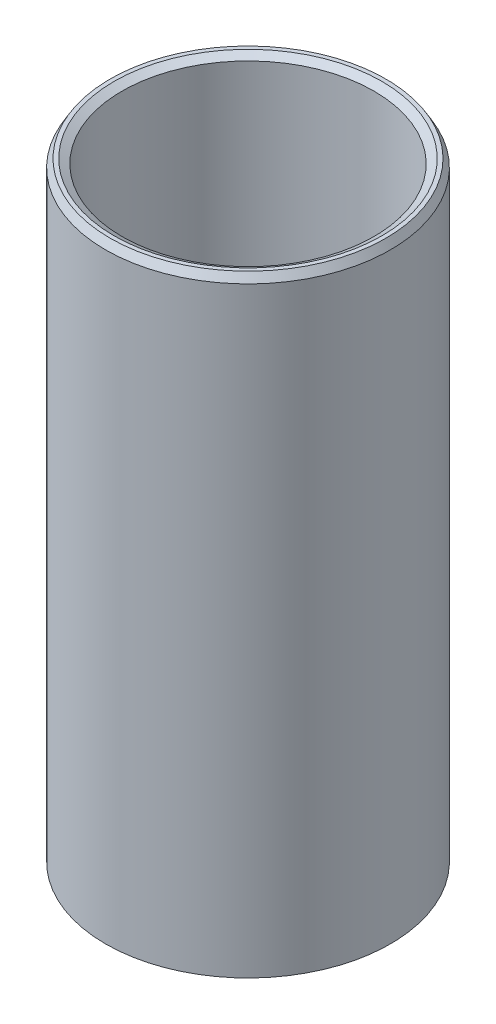
ISO-10303-21;
HEADER;
FILE_DESCRIPTION(('STEP AP214'),'2;1');
FILE_NAME('part.step','',(''),(''),'','','');
FILE_SCHEMA(('AUTOMOTIVE_DESIGN { 1 0 10303 214 1 1 1 1 }'));
ENDSEC;
DATA;
#1=APPLICATION_CONTEXT('core data for automotive mechanical design processes');
#2=APPLICATION_PROTOCOL_DEFINITION('international standard','automotive_design',2000,#1);
#3=PRODUCT_CONTEXT('',#1,'mechanical');
#4=PRODUCT('Part','Part','',(#3));
#5=PRODUCT_RELATED_PRODUCT_CATEGORY('part','',(#4));
#6=PRODUCT_DEFINITION_FORMATION('','',#4);
#7=PRODUCT_DEFINITION_CONTEXT('part definition',#1,'design');
#8=PRODUCT_DEFINITION('design','',#6,#7);
#9=PRODUCT_DEFINITION_SHAPE('','',#8);
#10=(LENGTH_UNIT() NAMED_UNIT(*) SI_UNIT(.MILLI.,.METRE.));
#11=(NAMED_UNIT(*) PLANE_ANGLE_UNIT() SI_UNIT($,.RADIAN.));
#12=(NAMED_UNIT(*) SI_UNIT($,.STERADIAN.) SOLID_ANGLE_UNIT());
#13=UNCERTAINTY_MEASURE_WITH_UNIT(LENGTH_MEASURE(1.E-05),#10,'distance_accuracy_value','');
#14=(GEOMETRIC_REPRESENTATION_CONTEXT(3) GLOBAL_UNCERTAINTY_ASSIGNED_CONTEXT((#13)) GLOBAL_UNIT_ASSIGNED_CONTEXT((#10,
#11,#12)) REPRESENTATION_CONTEXT('',''));
#15=CARTESIAN_POINT('',(0.,0.,0.));
#16=DIRECTION('',(0.,0.,1.));
#17=DIRECTION('',(1.,0.,0.));
#18=AXIS2_PLACEMENT_3D('',#15,#16,#17);
#19=CARTESIAN_POINT('',(0.,183.049954020556,0.));
#20=DIRECTION('',(0.,-1.,0.));
#21=DIRECTION('',(0.,0.,-1.));
#22=AXIS2_PLACEMENT_3D('',#19,#20,#21);
#23=CYLINDRICAL_SURFACE('',#22,42.5);
#24=CARTESIAN_POINT('',(0.,1.35133139128846,0.));
#25=DIRECTION('',(0.,1.,0.));
#26=DIRECTION('',(0.,0.,1.));
#27=AXIS2_PLACEMENT_3D('',#24,#25,#26);
#28=CIRCLE('',#27,42.5);
#29=CARTESIAN_POINT('',(0.,1.35133139128846,42.5));
#30=VERTEX_POINT('',#29);
#31=EDGE_CURVE('E10',#30,#30,#28,.T.);
#32=ORIENTED_EDGE('',*,*,#31,.T.);
#33=EDGE_LOOP('',(#32));
#34=FACE_BOUND('',#33,.T.);
#35=CARTESIAN_POINT('',(0.,180.709379392981,0.));
#36=DIRECTION('',(0.,1.,0.));
#37=DIRECTION('',(0.,0.,1.));
#38=AXIS2_PLACEMENT_3D('',#35,#36,#37);
#39=CIRCLE('',#38,42.5);
#40=CARTESIAN_POINT('',(0.,180.709379392981,42.5));
#41=VERTEX_POINT('',#40);
#42=EDGE_CURVE('E50',#41,#41,#39,.F.);
#43=ORIENTED_EDGE('',*,*,#42,.T.);
#44=EDGE_LOOP('',(#43));
#45=FACE_BOUND('',#44,.T.);
#46=ADVANCED_FACE('F39',(#34,#45),#23,.T.);
#47=CARTESIAN_POINT('',(0.,183.049954020556,0.));
#48=DIRECTION('',(0.,1.,0.));
#49=DIRECTION('',(0.,0.,1.));
#50=AXIS2_PLACEMENT_3D('',#47,#48,#49);
#51=PLANE('',#50);
#52=CARTESIAN_POINT('',(0.,183.049954020556,0.));
#53=DIRECTION('',(0.,1.,0.));
#54=DIRECTION('',(0.,0.,1.));
#55=AXIS2_PLACEMENT_3D('',#52,#53,#54);
#56=CIRCLE('',#55,39.9391665005552);
#57=CARTESIAN_POINT('',(0.,183.049954020556,39.9391665005552));
#58=VERTEX_POINT('',#57);
#59=EDGE_CURVE('E58',#58,#58,#56,.F.);
#60=ORIENTED_EDGE('',*,*,#59,.T.);
#61=EDGE_LOOP('',(#60));
#62=FACE_BOUND('',#61,.T.);
#63=CARTESIAN_POINT('',(0.,183.049954020556,0.));
#64=DIRECTION('',(0.,1.,0.));
#65=DIRECTION('',(0.,0.,1.));
#66=AXIS2_PLACEMENT_3D('',#63,#64,#65);
#67=CIRCLE('',#66,41.1486686087116);
#68=CARTESIAN_POINT('',(0.,183.049954020556,41.1486686087116));
#69=VERTEX_POINT('',#68);
#70=EDGE_CURVE('E61',#69,#69,#67,.T.);
#71=ORIENTED_EDGE('',*,*,#70,.T.);
#72=EDGE_LOOP('',(#71));
#73=FACE_BOUND('',#72,.T.);
#74=ADVANCED_FACE('F88',(#62,#73),#51,.T.);
#75=CARTESIAN_POINT('',(0.,0.,0.));
#76=DIRECTION('',(0.,1.,0.));
#77=DIRECTION('',(0.,0.,1.));
#78=AXIS2_PLACEMENT_3D('',#75,#76,#77);
#79=PLANE('',#78);
#80=CARTESIAN_POINT('',(0.,0.,0.));
#81=DIRECTION('',(0.,1.,0.));
#82=DIRECTION('',(0.,0.,1.));
#83=AXIS2_PLACEMENT_3D('',#80,#81,#82);
#84=CIRCLE('',#83,38.9499232642693);
#85=CARTESIAN_POINT('',(0.,0.,38.9499232642693));
#86=VERTEX_POINT('',#85);
#87=EDGE_CURVE('E51',#86,#86,#84,.T.);
#88=ORIENTED_EDGE('',*,*,#87,.T.);
#89=EDGE_LOOP('',(#88));
#90=FACE_BOUND('',#89,.T.);
#91=CARTESIAN_POINT('',(0.,0.,0.));
#92=DIRECTION('',(0.,1.,0.));
#93=DIRECTION('',(0.,0.,1.));
#94=AXIS2_PLACEMENT_3D('',#91,#92,#93);
#95=CIRCLE('',#94,40.1594253724256);
#96=CARTESIAN_POINT('',(0.,0.,40.1594253724256));
#97=VERTEX_POINT('',#96);
#98=EDGE_CURVE('E54',#97,#97,#95,.F.);
#99=ORIENTED_EDGE('',*,*,#98,.T.);
#100=EDGE_LOOP('',(#99));
#101=FACE_BOUND('',#100,.T.);
#102=ADVANCED_FACE('F83',(#90,#101),#79,.F.);
#103=CARTESIAN_POINT('',(0.,183.049954020556,0.));
#104=DIRECTION('',(0.,-1.,0.));
#105=DIRECTION('',(0.,0.,-1.));
#106=AXIS2_PLACEMENT_3D('',#103,#104,#105);
#107=CYLINDRICAL_SURFACE('',#106,37.5985918729808);
#108=CARTESIAN_POINT('',(0.,181.698622629267,0.));
#109=DIRECTION('',(0.,1.,0.));
#110=DIRECTION('',(0.,0.,1.));
#111=AXIS2_PLACEMENT_3D('',#108,#109,#110);
#112=CIRCLE('',#111,37.5985918729808);
#113=CARTESIAN_POINT('',(0.,181.698622629267,37.5985918729808));
#114=VERTEX_POINT('',#113);
#115=EDGE_CURVE('E67',#114,#114,#112,.T.);
#116=ORIENTED_EDGE('',*,*,#115,.T.);
#117=EDGE_LOOP('',(#116));
#118=FACE_BOUND('',#117,.T.);
#119=CARTESIAN_POINT('',(0.,2.34057462757439,0.));
#120=DIRECTION('',(0.,1.,0.));
#121=DIRECTION('',(0.,0.,1.));
#122=AXIS2_PLACEMENT_3D('',#119,#120,#121);
#123=CIRCLE('',#122,37.5985918729808);
#124=CARTESIAN_POINT('',(0.,2.34057462757439,37.5985918729808));
#125=VERTEX_POINT('',#124);
#126=EDGE_CURVE('E69',#125,#125,#123,.F.);
#127=ORIENTED_EDGE('',*,*,#126,.T.);
#128=EDGE_LOOP('',(#127));
#129=FACE_BOUND('',#128,.T.);
#130=ADVANCED_FACE('F71',(#118,#129),#107,.F.);
#131=CARTESIAN_POINT('',(0.,181.698622629267,0.));
#132=DIRECTION('',(0.,1.,0.));
#133=DIRECTION('',(0.,0.,1.));
#134=AXIS2_PLACEMENT_3D('',#131,#132,#133);
#135=CONICAL_SURFACE('',#134,37.5985918729808,1.0471975511966);
#136=ORIENTED_EDGE('',*,*,#59,.F.);
#137=EDGE_LOOP('',(#136));
#138=FACE_BOUND('',#137,.T.);
#139=ORIENTED_EDGE('',*,*,#115,.F.);
#140=EDGE_LOOP('',(#139));
#141=FACE_BOUND('',#140,.T.);
#142=ADVANCED_FACE('F77',(#138,#141),#135,.F.);
#143=CARTESIAN_POINT('',(0.,0.,0.));
#144=DIRECTION('',(0.,-1.,0.));
#145=DIRECTION('',(0.,0.,-1.));
#146=AXIS2_PLACEMENT_3D('',#143,#144,#145);
#147=CONICAL_SURFACE('',#146,38.9499232642693,0.523598775598295);
#148=ORIENTED_EDGE('',*,*,#126,.F.);
#149=EDGE_LOOP('',(#148));
#150=FACE_BOUND('',#149,.T.);
#151=ORIENTED_EDGE('',*,*,#87,.F.);
#152=EDGE_LOOP('',(#151));
#153=FACE_BOUND('',#152,.T.);
#154=ADVANCED_FACE('F73',(#150,#153),#147,.F.);
#155=CARTESIAN_POINT('',(0.,1.35133139128846,0.));
#156=DIRECTION('',(0.,1.,0.));
#157=DIRECTION('',(0.,0.,1.));
#158=AXIS2_PLACEMENT_3D('',#155,#156,#157);
#159=CONICAL_SURFACE('',#158,42.5,1.04719755119661);
#160=ORIENTED_EDGE('',*,*,#98,.F.);
#161=EDGE_LOOP('',(#160));
#162=FACE_BOUND('',#161,.T.);
#163=ORIENTED_EDGE('',*,*,#31,.F.);
#164=EDGE_LOOP('',(#163));
#165=FACE_BOUND('',#164,.T.);
#166=ADVANCED_FACE('F76',(#162,#165),#159,.T.);
#167=CARTESIAN_POINT('',(0.,183.049954020556,0.));
#168=DIRECTION('',(0.,-1.,0.));
#169=DIRECTION('',(0.,0.,-1.));
#170=AXIS2_PLACEMENT_3D('',#167,#168,#169);
#171=CONICAL_SURFACE('',#170,41.1486686087116,0.52359877559829);
#172=ORIENTED_EDGE('',*,*,#42,.F.);
#173=EDGE_LOOP('',(#172));
#174=FACE_BOUND('',#173,.T.);
#175=ORIENTED_EDGE('',*,*,#70,.F.);
#176=EDGE_LOOP('',(#175));
#177=FACE_BOUND('',#176,.T.);
#178=ADVANCED_FACE('F45',(#174,#177),#171,.T.);
#179=CLOSED_SHELL('',(#46,#74,#102,#130,#142,#154,#166,#178));
#180=MANIFOLD_SOLID_BREP('B2',#179);
#181=ADVANCED_BREP_SHAPE_REPRESENTATION('',(#18,#180),#14);
#182=SHAPE_DEFINITION_REPRESENTATION(#9,#181);
ENDSEC;
END-ISO-10303-21;
